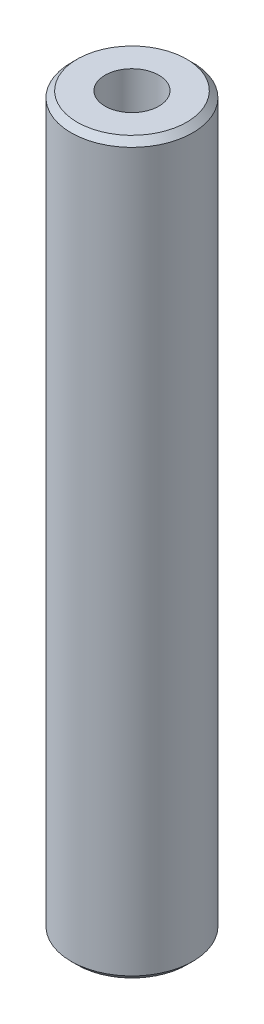
ISO-10303-21;
HEADER;
FILE_DESCRIPTION(('STEP AP214'),'2;1');
FILE_NAME('part.step','',(''),(''),'','','');
FILE_SCHEMA(('AUTOMOTIVE_DESIGN { 1 0 10303 214 1 1 1 1 }'));
ENDSEC;
DATA;
#1=APPLICATION_CONTEXT('core data for automotive mechanical design processes');
#2=APPLICATION_PROTOCOL_DEFINITION('international standard','automotive_design',2000,#1);
#3=PRODUCT_CONTEXT('',#1,'mechanical');
#4=PRODUCT('Part','Part','',(#3));
#5=PRODUCT_RELATED_PRODUCT_CATEGORY('part','',(#4));
#6=PRODUCT_DEFINITION_FORMATION('','',#4);
#7=PRODUCT_DEFINITION_CONTEXT('part definition',#1,'design');
#8=PRODUCT_DEFINITION('design','',#6,#7);
#9=PRODUCT_DEFINITION_SHAPE('','',#8);
#10=(LENGTH_UNIT() NAMED_UNIT(*) SI_UNIT(.MILLI.,.METRE.));
#11=(NAMED_UNIT(*) PLANE_ANGLE_UNIT() SI_UNIT($,.RADIAN.));
#12=(NAMED_UNIT(*) SI_UNIT($,.STERADIAN.) SOLID_ANGLE_UNIT());
#13=UNCERTAINTY_MEASURE_WITH_UNIT(LENGTH_MEASURE(1.E-05),#10,'distance_accuracy_value','');
#14=(GEOMETRIC_REPRESENTATION_CONTEXT(3) GLOBAL_UNCERTAINTY_ASSIGNED_CONTEXT((#13)) GLOBAL_UNIT_ASSIGNED_CONTEXT((#10,
#11,#12)) REPRESENTATION_CONTEXT('',''));
#15=CARTESIAN_POINT('',(0.,0.,0.));
#16=DIRECTION('',(0.,0.,1.));
#17=DIRECTION('',(1.,0.,0.));
#18=AXIS2_PLACEMENT_3D('',#15,#16,#17);
#19=CARTESIAN_POINT('',(0.,600.,0.));
#20=DIRECTION('',(0.,-1.,0.));
#21=DIRECTION('',(0.,0.,-1.));
#22=AXIS2_PLACEMENT_3D('',#19,#20,#21);
#23=CYLINDRICAL_SURFACE('',#22,50.);
#24=CARTESIAN_POINT('',(0.,594.981760090434,0.));
#25=DIRECTION('',(0.,1.,0.));
#26=DIRECTION('',(0.,0.,1.));
#27=AXIS2_PLACEMENT_3D('',#24,#25,#26);
#28=CIRCLE('',#27,50.);
#29=CARTESIAN_POINT('',(0.,594.981760090434,50.));
#30=VERTEX_POINT('',#29);
#31=EDGE_CURVE('E50',#30,#30,#28,.F.);
#32=ORIENTED_EDGE('',*,*,#31,.T.);
#33=EDGE_LOOP('',(#32));
#34=FACE_BOUND('',#33,.T.);
#35=CARTESIAN_POINT('',(0.,5.01823990956551,0.));
#36=DIRECTION('',(0.,1.,0.));
#37=DIRECTION('',(0.,0.,1.));
#38=AXIS2_PLACEMENT_3D('',#35,#36,#37);
#39=CIRCLE('',#38,50.);
#40=CARTESIAN_POINT('',(0.,5.01823990956551,50.));
#41=VERTEX_POINT('',#40);
#42=EDGE_CURVE('E51',#41,#41,#39,.T.);
#43=ORIENTED_EDGE('',*,*,#42,.T.);
#44=EDGE_LOOP('',(#43));
#45=FACE_BOUND('',#44,.T.);
#46=ADVANCED_FACE('F39',(#34,#45),#23,.T.);
#47=CARTESIAN_POINT('',(0.,600.,0.));
#48=DIRECTION('',(0.,1.,0.));
#49=DIRECTION('',(0.,0.,1.));
#50=AXIS2_PLACEMENT_3D('',#47,#48,#49);
#51=PLANE('',#50);
#52=CARTESIAN_POINT('',(0.,600.,0.));
#53=DIRECTION('',(0.,1.,0.));
#54=DIRECTION('',(0.,0.,1.));
#55=AXIS2_PLACEMENT_3D('',#52,#53,#54);
#56=CIRCLE('',#55,44.9817600904345);
#57=CARTESIAN_POINT('',(0.,600.,44.9817600904345));
#58=VERTEX_POINT('',#57);
#59=EDGE_CURVE('E54',#58,#58,#56,.T.);
#60=ORIENTED_EDGE('',*,*,#59,.T.);
#61=EDGE_LOOP('',(#60));
#62=FACE_BOUND('',#61,.T.);
#63=CARTESIAN_POINT('',(0.,600.,0.));
#64=DIRECTION('',(0.,1.,0.));
#65=DIRECTION('',(0.,0.,1.));
#66=AXIS2_PLACEMENT_3D('',#63,#64,#65);
#67=CIRCLE('',#66,22.1297914958177);
#68=CARTESIAN_POINT('',(0.,600.,22.1297914958177));
#69=VERTEX_POINT('',#68);
#70=EDGE_CURVE('E58',#69,#69,#67,.T.);
#71=ORIENTED_EDGE('',*,*,#70,.F.);
#72=EDGE_LOOP('',(#71));
#73=FACE_BOUND('',#72,.T.);
#74=ADVANCED_FACE('F69',(#62,#73),#51,.T.);
#75=CARTESIAN_POINT('',(0.,0.,0.));
#76=DIRECTION('',(0.,1.,0.));
#77=DIRECTION('',(0.,0.,1.));
#78=AXIS2_PLACEMENT_3D('',#75,#76,#77);
#79=PLANE('',#78);
#80=CARTESIAN_POINT('',(0.,0.,0.));
#81=DIRECTION('',(0.,1.,0.));
#82=DIRECTION('',(0.,0.,1.));
#83=AXIS2_PLACEMENT_3D('',#80,#81,#82);
#84=CIRCLE('',#83,44.9817600904344);
#85=CARTESIAN_POINT('',(0.,0.,44.9817600904344));
#86=VERTEX_POINT('',#85);
#87=EDGE_CURVE('E10',#86,#86,#84,.F.);
#88=ORIENTED_EDGE('',*,*,#87,.T.);
#89=EDGE_LOOP('',(#88));
#90=FACE_BOUND('',#89,.T.);
#91=CARTESIAN_POINT('',(0.,0.,0.));
#92=DIRECTION('',(0.,1.,0.));
#93=DIRECTION('',(0.,0.,1.));
#94=AXIS2_PLACEMENT_3D('',#91,#92,#93);
#95=CIRCLE('',#94,22.1297914958177);
#96=CARTESIAN_POINT('',(0.,0.,22.1297914958177));
#97=VERTEX_POINT('',#96);
#98=EDGE_CURVE('E63',#97,#97,#95,.T.);
#99=ORIENTED_EDGE('',*,*,#98,.T.);
#100=EDGE_LOOP('',(#99));
#101=FACE_BOUND('',#100,.T.);
#102=ADVANCED_FACE('F75',(#90,#101),#79,.F.);
#103=CARTESIAN_POINT('',(0.,600.,0.));
#104=DIRECTION('',(0.,-1.,0.));
#105=DIRECTION('',(0.,0.,-1.));
#106=AXIS2_PLACEMENT_3D('',#103,#104,#105);
#107=CYLINDRICAL_SURFACE('',#106,22.1297914958177);
#108=ORIENTED_EDGE('',*,*,#70,.T.);
#109=EDGE_LOOP('',(#108));
#110=FACE_BOUND('',#109,.T.);
#111=ORIENTED_EDGE('',*,*,#98,.F.);
#112=EDGE_LOOP('',(#111));
#113=FACE_BOUND('',#112,.T.);
#114=ADVANCED_FACE('F70',(#110,#113),#107,.F.);
#115=CARTESIAN_POINT('',(0.,600.,0.));
#116=DIRECTION('',(0.,-1.,0.));
#117=DIRECTION('',(0.,0.,-1.));
#118=AXIS2_PLACEMENT_3D('',#115,#116,#117);
#119=CONICAL_SURFACE('',#118,44.9817600904345,0.78539816339745);
#120=ORIENTED_EDGE('',*,*,#31,.F.);
#121=EDGE_LOOP('',(#120));
#122=FACE_BOUND('',#121,.T.);
#123=ORIENTED_EDGE('',*,*,#59,.F.);
#124=EDGE_LOOP('',(#123));
#125=FACE_BOUND('',#124,.T.);
#126=ADVANCED_FACE('F81',(#122,#125),#119,.T.);
#127=CARTESIAN_POINT('',(0.,5.01823990956551,0.));
#128=DIRECTION('',(0.,1.,0.));
#129=DIRECTION('',(0.,0.,1.));
#130=AXIS2_PLACEMENT_3D('',#127,#128,#129);
#131=CONICAL_SURFACE('',#130,50.,0.785398163397454);
#132=ORIENTED_EDGE('',*,*,#87,.F.);
#133=EDGE_LOOP('',(#132));
#134=FACE_BOUND('',#133,.T.);
#135=ORIENTED_EDGE('',*,*,#42,.F.);
#136=EDGE_LOOP('',(#135));
#137=FACE_BOUND('',#136,.T.);
#138=ADVANCED_FACE('F45',(#134,#137),#131,.T.);
#139=CLOSED_SHELL('',(#46,#74,#102,#114,#126,#138));
#140=MANIFOLD_SOLID_BREP('B2',#139);
#141=ADVANCED_BREP_SHAPE_REPRESENTATION('',(#18,#140),#14);
#142=SHAPE_DEFINITION_REPRESENTATION(#9,#141);
ENDSEC;
END-ISO-10303-21;
